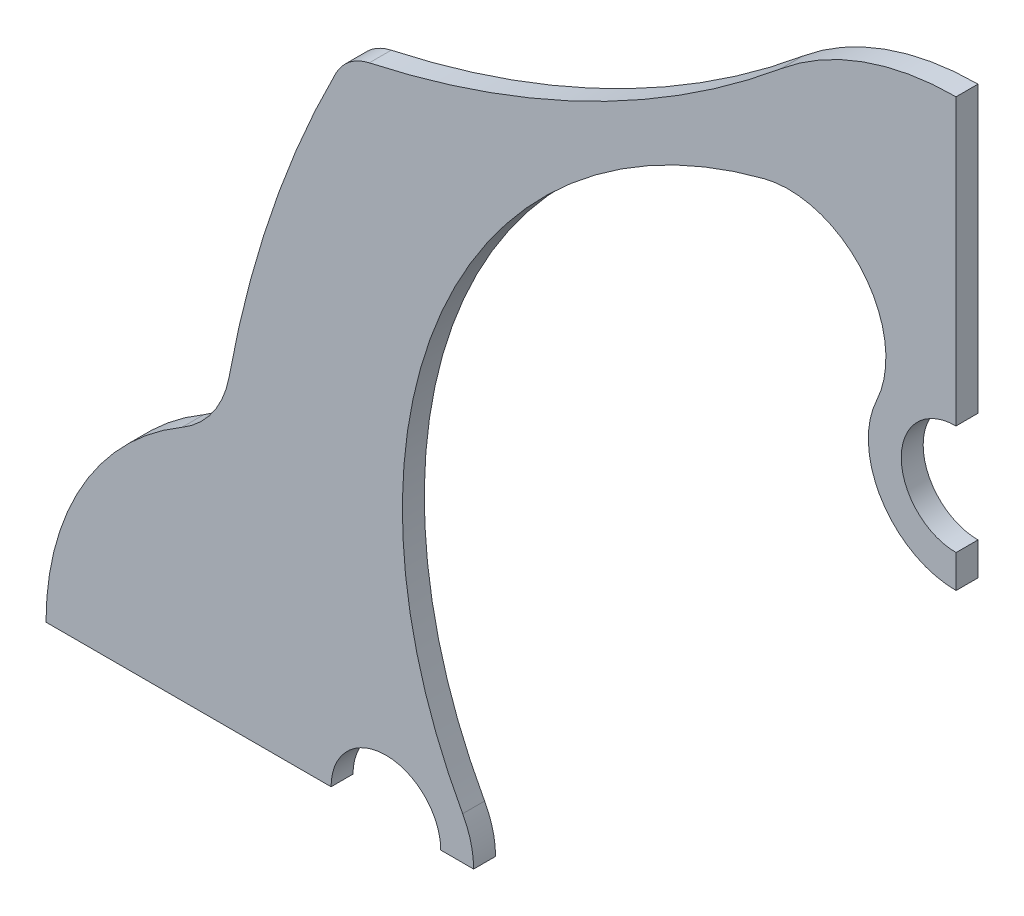
ISO-10303-21;
HEADER;
FILE_DESCRIPTION(('STEP AP214'),'2;1');
FILE_NAME('part.step','',(''),(''),'','','');
FILE_SCHEMA(('AUTOMOTIVE_DESIGN { 1 0 10303 214 1 1 1 1 }'));
ENDSEC;
DATA;
#1=APPLICATION_CONTEXT('core data for automotive mechanical design processes');
#2=APPLICATION_PROTOCOL_DEFINITION('international standard','automotive_design',2000,#1);
#3=PRODUCT_CONTEXT('',#1,'mechanical');
#4=PRODUCT('Part','Part','',(#3));
#5=PRODUCT_RELATED_PRODUCT_CATEGORY('part','',(#4));
#6=PRODUCT_DEFINITION_FORMATION('','',#4);
#7=PRODUCT_DEFINITION_CONTEXT('part definition',#1,'design');
#8=PRODUCT_DEFINITION('design','',#6,#7);
#9=PRODUCT_DEFINITION_SHAPE('','',#8);
#10=(LENGTH_UNIT() NAMED_UNIT(*) SI_UNIT(.MILLI.,.METRE.));
#11=(NAMED_UNIT(*) PLANE_ANGLE_UNIT() SI_UNIT($,.RADIAN.));
#12=(NAMED_UNIT(*) SI_UNIT($,.STERADIAN.) SOLID_ANGLE_UNIT());
#13=UNCERTAINTY_MEASURE_WITH_UNIT(LENGTH_MEASURE(1.E-05),#10,'distance_accuracy_value','');
#14=(GEOMETRIC_REPRESENTATION_CONTEXT(3) GLOBAL_UNCERTAINTY_ASSIGNED_CONTEXT((#13)) GLOBAL_UNIT_ASSIGNED_CONTEXT((#10,
#11,#12)) REPRESENTATION_CONTEXT('',''));
#15=CARTESIAN_POINT('',(0.,0.,0.));
#16=DIRECTION('',(0.,0.,1.));
#17=DIRECTION('',(1.,0.,0.));
#18=AXIS2_PLACEMENT_3D('',#15,#16,#17);
#19=CARTESIAN_POINT('',(-52.,0.,1.));
#20=DIRECTION('',(0.,0.,-1.));
#21=DIRECTION('',(-1.,0.,0.));
#22=AXIS2_PLACEMENT_3D('',#19,#20,#21);
#23=CYLINDRICAL_SURFACE('',#22,8.00000000000004);
#24=CARTESIAN_POINT('',(-52.,0.,-1.));
#25=DIRECTION('',(0.,0.,1.));
#26=DIRECTION('',(-1.,0.,0.));
#27=AXIS2_PLACEMENT_3D('',#24,#25,#26);
#28=CIRCLE('',#27,8.00000000000004);
#29=CARTESIAN_POINT('',(-44.,0.,-1.));
#30=VERTEX_POINT('',#29);
#31=CARTESIAN_POINT('',(-45.,3.87298334620741,-1.));
#32=VERTEX_POINT('',#31);
#33=EDGE_CURVE('E176',#30,#32,#28,.T.);
#34=ORIENTED_EDGE('',*,*,#33,.T.);
#35=DIRECTION('',(0.,0.,-1.));
#36=VECTOR('',#35,1.);
#37=CARTESIAN_POINT('',(-45.,3.87298334620741,1.));
#38=LINE('',#37,#36);
#39=CARTESIAN_POINT('',(-45.,3.87298334620741,1.));
#40=VERTEX_POINT('',#39);
#41=EDGE_CURVE('E11',#40,#32,#38,.T.);
#42=ORIENTED_EDGE('',*,*,#41,.F.);
#43=CARTESIAN_POINT('',(-52.,0.,1.));
#44=DIRECTION('',(0.,0.,1.));
#45=DIRECTION('',(-1.,0.,0.));
#46=AXIS2_PLACEMENT_3D('',#43,#44,#45);
#47=CIRCLE('',#46,8.00000000000004);
#48=CARTESIAN_POINT('',(-44.,0.,1.));
#49=VERTEX_POINT('',#48);
#50=EDGE_CURVE('E206',#49,#40,#47,.T.);
#51=ORIENTED_EDGE('',*,*,#50,.F.);
#52=DIRECTION('',(0.,0.,-1.));
#53=VECTOR('',#52,1.);
#54=CARTESIAN_POINT('',(-44.,0.,1.));
#55=LINE('',#54,#53);
#56=EDGE_CURVE('E172',#49,#30,#55,.T.);
#57=ORIENTED_EDGE('',*,*,#56,.T.);
#58=EDGE_LOOP('',(#34,#42,#51,#57));
#59=FACE_BOUND('',#58,.T.);
#60=ADVANCED_FACE('F32',(#59),#23,.T.);
#61=CARTESIAN_POINT('',(-6.50000000000001,25.1743917503482,1.));
#62=DIRECTION('',(0.,0.,-1.));
#63=DIRECTION('',(-1.,0.,0.));
#64=AXIS2_PLACEMENT_3D('',#61,#62,#63);
#65=CYLINDRICAL_SURFACE('',#64,44.);
#66=CARTESIAN_POINT('',(-6.50000000000001,25.1743917503482,-1.));
#67=DIRECTION('',(0.,0.,-1.));
#68=DIRECTION('',(-1.,0.,0.));
#69=AXIS2_PLACEMENT_3D('',#66,#67,#68);
#70=CIRCLE('',#69,44.);
#71=CARTESIAN_POINT('',(-17.5,67.7772085586298,-1.));
#72=VERTEX_POINT('',#71);
#73=EDGE_CURVE('E179',#32,#72,#70,.T.);
#74=ORIENTED_EDGE('',*,*,#73,.T.);
#75=DIRECTION('',(0.,0.,-1.));
#76=VECTOR('',#75,1.);
#77=CARTESIAN_POINT('',(-17.5,67.7772085586298,1.));
#78=LINE('',#77,#76);
#79=CARTESIAN_POINT('',(-17.5,67.7772085586298,1.));
#80=VERTEX_POINT('',#79);
#81=EDGE_CURVE('E40',#80,#72,#78,.T.);
#82=ORIENTED_EDGE('',*,*,#81,.F.);
#83=CARTESIAN_POINT('',(-6.50000000000001,25.1743917503482,1.));
#84=DIRECTION('',(0.,0.,-1.));
#85=DIRECTION('',(-1.,0.,0.));
#86=AXIS2_PLACEMENT_3D('',#83,#84,#85);
#87=CIRCLE('',#86,44.);
#88=EDGE_CURVE('E115',#40,#80,#87,.T.);
#89=ORIENTED_EDGE('',*,*,#88,.F.);
#90=ORIENTED_EDGE('',*,*,#41,.T.);
#91=EDGE_LOOP('',(#74,#82,#89,#90));
#92=FACE_BOUND('',#91,.T.);
#93=ADVANCED_FACE('F304',(#92),#65,.F.);
#94=CARTESIAN_POINT('',(-15.2796170834163,59.1777025004974,1.));
#95=DIRECTION('',(0.,0.,-1.));
#96=DIRECTION('',(-1.,0.,0.));
#97=AXIS2_PLACEMENT_3D('',#94,#95,#96);
#98=CYLINDRICAL_SURFACE('',#97,8.88153166633505);
#99=CARTESIAN_POINT('',(-15.2796170834163,59.1777025004974,-1.));
#100=DIRECTION('',(0.,0.,-1.));
#101=DIRECTION('',(-1.,0.,0.));
#102=AXIS2_PLACEMENT_3D('',#99,#100,#101);
#103=CIRCLE('',#102,8.88153166633505);
#104=CARTESIAN_POINT('',(-7.24086765841832,55.4014460973638,-1.));
#105=VERTEX_POINT('',#104);
#106=EDGE_CURVE('E181',#72,#105,#103,.T.);
#107=ORIENTED_EDGE('',*,*,#106,.T.);
#108=DIRECTION('',(0.,0.,-1.));
#109=VECTOR('',#108,1.);
#110=CARTESIAN_POINT('',(-7.24086765841832,55.4014460973638,1.));
#111=LINE('',#110,#109);
#112=CARTESIAN_POINT('',(-7.24086765841832,55.4014460973638,1.));
#113=VERTEX_POINT('',#112);
#114=EDGE_CURVE('E237',#113,#105,#111,.T.);
#115=ORIENTED_EDGE('',*,*,#114,.F.);
#116=CARTESIAN_POINT('',(-15.2796170834163,59.1777025004974,1.));
#117=DIRECTION('',(0.,0.,-1.));
#118=DIRECTION('',(-1.,0.,0.));
#119=AXIS2_PLACEMENT_3D('',#116,#117,#118);
#120=CIRCLE('',#119,8.88153166633505);
#121=EDGE_CURVE('E245',#80,#113,#120,.T.);
#122=ORIENTED_EDGE('',*,*,#121,.F.);
#123=ORIENTED_EDGE('',*,*,#81,.T.);
#124=EDGE_LOOP('',(#107,#115,#122,#123));
#125=FACE_BOUND('',#124,.T.);
#126=ADVANCED_FACE('F243',(#125),#98,.F.);
#127=CARTESIAN_POINT('',(0.,52.,1.));
#128=DIRECTION('',(0.,0.,-1.));
#129=DIRECTION('',(-1.,0.,0.));
#130=AXIS2_PLACEMENT_3D('',#127,#128,#129);
#131=CYLINDRICAL_SURFACE('',#130,8.00000000000001);
#132=CARTESIAN_POINT('',(0.,52.,-1.));
#133=DIRECTION('',(0.,0.,1.));
#134=DIRECTION('',(1.,0.,0.));
#135=AXIS2_PLACEMENT_3D('',#132,#133,#134);
#136=CIRCLE('',#135,8.00000000000001);
#137=CARTESIAN_POINT('',(0.,44.,-1.));
#138=VERTEX_POINT('',#137);
#139=EDGE_CURVE('E183',#105,#138,#136,.T.);
#140=ORIENTED_EDGE('',*,*,#139,.T.);
#141=DIRECTION('',(0.,0.,-1.));
#142=VECTOR('',#141,1.);
#143=CARTESIAN_POINT('',(0.,44.,1.));
#144=LINE('',#143,#142);
#145=CARTESIAN_POINT('',(0.,44.,1.));
#146=VERTEX_POINT('',#145);
#147=EDGE_CURVE('E234',#146,#138,#144,.T.);
#148=ORIENTED_EDGE('',*,*,#147,.F.);
#149=CARTESIAN_POINT('',(0.,52.,1.));
#150=DIRECTION('',(0.,0.,1.));
#151=DIRECTION('',(1.,0.,0.));
#152=AXIS2_PLACEMENT_3D('',#149,#150,#151);
#153=CIRCLE('',#152,8.00000000000001);
#154=EDGE_CURVE('E263',#113,#146,#153,.T.);
#155=ORIENTED_EDGE('',*,*,#154,.F.);
#156=ORIENTED_EDGE('',*,*,#114,.T.);
#157=EDGE_LOOP('',(#140,#148,#155,#156));
#158=FACE_BOUND('',#157,.T.);
#159=ADVANCED_FACE('F254',(#158),#131,.T.);
#160=CARTESIAN_POINT('',(0.,44.,1.));
#161=DIRECTION('',(-1.,0.,0.));
#162=DIRECTION('',(0.,0.,1.));
#163=AXIS2_PLACEMENT_3D('',#160,#161,#162);
#164=PLANE('',#163);
#165=DIRECTION('',(0.,1.,0.));
#166=VECTOR('',#165,1.);
#167=CARTESIAN_POINT('',(0.,44.,-1.));
#168=LINE('',#167,#166);
#169=CARTESIAN_POINT('',(0.,47.,-1.));
#170=VERTEX_POINT('',#169);
#171=EDGE_CURVE('E185',#138,#170,#168,.T.);
#172=ORIENTED_EDGE('',*,*,#171,.T.);
#173=DIRECTION('',(0.,0.,-1.));
#174=VECTOR('',#173,1.);
#175=CARTESIAN_POINT('',(0.,47.,1.));
#176=LINE('',#175,#174);
#177=CARTESIAN_POINT('',(0.,47.,1.));
#178=VERTEX_POINT('',#177);
#179=EDGE_CURVE('E231',#178,#170,#176,.T.);
#180=ORIENTED_EDGE('',*,*,#179,.F.);
#181=DIRECTION('',(0.,1.,0.));
#182=VECTOR('',#181,1.);
#183=CARTESIAN_POINT('',(0.,44.,1.));
#184=LINE('',#183,#182);
#185=EDGE_CURVE('E260',#146,#178,#184,.T.);
#186=ORIENTED_EDGE('',*,*,#185,.F.);
#187=ORIENTED_EDGE('',*,*,#147,.T.);
#188=EDGE_LOOP('',(#172,#180,#186,#187));
#189=FACE_BOUND('',#188,.T.);
#190=ADVANCED_FACE('F258',(#189),#164,.F.);
#191=CARTESIAN_POINT('',(0.,52.,1.));
#192=DIRECTION('',(0.,0.,-1.));
#193=DIRECTION('',(-1.,0.,0.));
#194=AXIS2_PLACEMENT_3D('',#191,#192,#193);
#195=CYLINDRICAL_SURFACE('',#194,5.);
#196=CARTESIAN_POINT('',(0.,52.,-1.));
#197=DIRECTION('',(0.,0.,-1.));
#198=DIRECTION('',(1.,0.,0.));
#199=AXIS2_PLACEMENT_3D('',#196,#197,#198);
#200=CIRCLE('',#199,5.);
#201=CARTESIAN_POINT('',(0.,57.,-1.));
#202=VERTEX_POINT('',#201);
#203=EDGE_CURVE('E187',#170,#202,#200,.T.);
#204=ORIENTED_EDGE('',*,*,#203,.T.);
#205=DIRECTION('',(0.,0.,-1.));
#206=VECTOR('',#205,1.);
#207=CARTESIAN_POINT('',(0.,57.,1.));
#208=LINE('',#207,#206);
#209=CARTESIAN_POINT('',(0.,57.,1.));
#210=VERTEX_POINT('',#209);
#211=EDGE_CURVE('E228',#210,#202,#208,.T.);
#212=ORIENTED_EDGE('',*,*,#211,.F.);
#213=CARTESIAN_POINT('',(0.,52.,1.));
#214=DIRECTION('',(0.,0.,-1.));
#215=DIRECTION('',(1.,0.,0.));
#216=AXIS2_PLACEMENT_3D('',#213,#214,#215);
#217=CIRCLE('',#216,5.);
#218=EDGE_CURVE('E262',#178,#210,#217,.T.);
#219=ORIENTED_EDGE('',*,*,#218,.F.);
#220=ORIENTED_EDGE('',*,*,#179,.T.);
#221=EDGE_LOOP('',(#204,#212,#219,#220));
#222=FACE_BOUND('',#221,.T.);
#223=ADVANCED_FACE('F317',(#222),#195,.F.);
#224=CARTESIAN_POINT('',(2.64922717411103E-13,83.,1.));
#225=DIRECTION('',(-1.,0.,0.));
#226=DIRECTION('',(0.,-1.,0.));
#227=AXIS2_PLACEMENT_3D('',#224,#225,#226);
#228=PLANE('',#227);
#229=DIRECTION('',(0.,1.,0.));
#230=VECTOR('',#229,1.);
#231=CARTESIAN_POINT('',(2.64922717411103E-13,83.,-1.));
#232=LINE('',#231,#230);
#233=CARTESIAN_POINT('',(2.64922717411103E-13,83.,-1.));
#234=VERTEX_POINT('',#233);
#235=EDGE_CURVE('E189',#202,#234,#232,.T.);
#236=ORIENTED_EDGE('',*,*,#235,.T.);
#237=DIRECTION('',(0.,0.,-1.));
#238=VECTOR('',#237,1.);
#239=CARTESIAN_POINT('',(2.64922717411103E-13,83.,1.));
#240=LINE('',#239,#238);
#241=CARTESIAN_POINT('',(2.64922717411103E-13,83.,1.));
#242=VERTEX_POINT('',#241);
#243=EDGE_CURVE('E225',#242,#234,#240,.T.);
#244=ORIENTED_EDGE('',*,*,#243,.F.);
#245=DIRECTION('',(0.,1.,0.));
#246=VECTOR('',#245,1.);
#247=CARTESIAN_POINT('',(2.64922717411103E-13,83.,1.));
#248=LINE('',#247,#246);
#249=EDGE_CURVE('E265',#210,#242,#248,.T.);
#250=ORIENTED_EDGE('',*,*,#249,.F.);
#251=ORIENTED_EDGE('',*,*,#211,.T.);
#252=EDGE_LOOP('',(#236,#244,#250,#251));
#253=FACE_BOUND('',#252,.T.);
#254=ADVANCED_FACE('F320',(#253),#228,.F.);
#255=CARTESIAN_POINT('',(0.,58.,1.));
#256=DIRECTION('',(0.,0.,-1.));
#257=DIRECTION('',(-1.,0.,0.));
#258=AXIS2_PLACEMENT_3D('',#255,#256,#257);
#259=CYLINDRICAL_SURFACE('',#258,25.);
#260=CARTESIAN_POINT('',(0.,58.,-1.));
#261=DIRECTION('',(0.,0.,1.));
#262=DIRECTION('',(-1.,0.,0.));
#263=AXIS2_PLACEMENT_3D('',#260,#261,#262);
#264=CIRCLE('',#263,25.);
#265=CARTESIAN_POINT('',(-15.9770127870759,77.2284961034818,-1.));
#266=VERTEX_POINT('',#265);
#267=EDGE_CURVE('E191',#234,#266,#264,.T.);
#268=ORIENTED_EDGE('',*,*,#267,.T.);
#269=DIRECTION('',(0.,0.,-1.));
#270=VECTOR('',#269,1.);
#271=CARTESIAN_POINT('',(-15.9770127870759,77.2284961034818,1.));
#272=LINE('',#271,#270);
#273=CARTESIAN_POINT('',(-15.9770127870759,77.2284961034818,1.));
#274=VERTEX_POINT('',#273);
#275=EDGE_CURVE('E222',#274,#266,#272,.T.);
#276=ORIENTED_EDGE('',*,*,#275,.F.);
#277=CARTESIAN_POINT('',(0.,58.,1.));
#278=DIRECTION('',(0.,0.,1.));
#279=DIRECTION('',(-1.,0.,0.));
#280=AXIS2_PLACEMENT_3D('',#277,#278,#279);
#281=CIRCLE('',#280,25.);
#282=EDGE_CURVE('E271',#242,#274,#281,.T.);
#283=ORIENTED_EDGE('',*,*,#282,.F.);
#284=ORIENTED_EDGE('',*,*,#243,.T.);
#285=EDGE_LOOP('',(#268,#276,#283,#284));
#286=FACE_BOUND('',#285,.T.);
#287=ADVANCED_FACE('F324',(#286),#259,.T.);
#288=CARTESIAN_POINT('',(-72.2160977975829,144.912802387738,1.));
#289=DIRECTION('',(0.,0.,-1.));
#290=DIRECTION('',(-1.,0.,0.));
#291=AXIS2_PLACEMENT_3D('',#288,#289,#290);
#292=CYLINDRICAL_SURFACE('',#291,88.);
#293=CARTESIAN_POINT('',(-72.2160977975829,144.912802387738,-1.));
#294=DIRECTION('',(0.,0.,-1.));
#295=DIRECTION('',(1.,0.,0.));
#296=AXIS2_PLACEMENT_3D('',#293,#294,#295);
#297=CIRCLE('',#296,88.);
#298=CARTESIAN_POINT('',(-53.515303741231,58.9228012151484,-1.));
#299=VERTEX_POINT('',#298);
#300=EDGE_CURVE('E193',#266,#299,#297,.T.);
#301=ORIENTED_EDGE('',*,*,#300,.T.);
#302=DIRECTION('',(0.,0.,-1.));
#303=VECTOR('',#302,1.);
#304=CARTESIAN_POINT('',(-53.515303741231,58.9228012151484,1.));
#305=LINE('',#304,#303);
#306=CARTESIAN_POINT('',(-53.515303741231,58.9228012151484,1.));
#307=VERTEX_POINT('',#306);
#308=EDGE_CURVE('E219',#307,#299,#305,.T.);
#309=ORIENTED_EDGE('',*,*,#308,.F.);
#310=CARTESIAN_POINT('',(-72.2160977975829,144.912802387738,1.));
#311=DIRECTION('',(0.,0.,-1.));
#312=DIRECTION('',(1.,0.,0.));
#313=AXIS2_PLACEMENT_3D('',#310,#311,#312);
#314=CIRCLE('',#313,88.);
#315=EDGE_CURVE('E273',#274,#307,#314,.T.);
#316=ORIENTED_EDGE('',*,*,#315,.F.);
#317=ORIENTED_EDGE('',*,*,#275,.T.);
#318=EDGE_LOOP('',(#301,#309,#316,#317));
#319=FACE_BOUND('',#318,.T.);
#320=ADVANCED_FACE('F328',(#319),#292,.F.);
#321=CARTESIAN_POINT('',(-52.5590131360765,54.5255852460956,1.));
#322=DIRECTION('',(0.,0.,-1.));
#323=DIRECTION('',(-1.,0.,0.));
#324=AXIS2_PLACEMENT_3D('',#321,#322,#323);
#325=CYLINDRICAL_SURFACE('',#324,4.49999999999991);
#326=CARTESIAN_POINT('',(-52.5590131360765,54.5255852460956,-1.));
#327=DIRECTION('',(0.,0.,1.));
#328=DIRECTION('',(1.,0.,0.));
#329=AXIS2_PLACEMENT_3D('',#326,#327,#328);
#330=CIRCLE('',#329,4.49999999999991);
#331=CARTESIAN_POINT('',(-56.5685424949241,56.5685424949235,-1.));
#332=VERTEX_POINT('',#331);
#333=EDGE_CURVE('E195',#299,#332,#330,.T.);
#334=ORIENTED_EDGE('',*,*,#333,.T.);
#335=DIRECTION('',(0.,0.,-1.));
#336=VECTOR('',#335,1.);
#337=CARTESIAN_POINT('',(-56.5685424949241,56.5685424949235,1.));
#338=LINE('',#337,#336);
#339=CARTESIAN_POINT('',(-56.5685424949241,56.5685424949235,1.));
#340=VERTEX_POINT('',#339);
#341=EDGE_CURVE('E216',#340,#332,#338,.T.);
#342=ORIENTED_EDGE('',*,*,#341,.F.);
#343=CARTESIAN_POINT('',(-52.5590131360765,54.5255852460956,1.));
#344=DIRECTION('',(0.,0.,1.));
#345=DIRECTION('',(1.,0.,0.));
#346=AXIS2_PLACEMENT_3D('',#343,#344,#345);
#347=CIRCLE('',#346,4.49999999999991);
#348=EDGE_CURVE('E275',#307,#340,#347,.T.);
#349=ORIENTED_EDGE('',*,*,#348,.F.);
#350=ORIENTED_EDGE('',*,*,#308,.T.);
#351=EDGE_LOOP('',(#334,#342,#349,#350));
#352=FACE_BOUND('',#351,.T.);
#353=ADVANCED_FACE('F332',(#352),#325,.T.);
#354=CARTESIAN_POINT('',(36.7015730945028,9.04504492482461,1.));
#355=DIRECTION('',(0.,0.,-1.));
#356=DIRECTION('',(-1.,0.,0.));
#357=AXIS2_PLACEMENT_3D('',#354,#355,#356);
#358=CYLINDRICAL_SURFACE('',#357,104.679497913203);
#359=CARTESIAN_POINT('',(36.7015730945028,9.04504492482461,-1.));
#360=DIRECTION('',(0.,0.,1.));
#361=DIRECTION('',(1.,0.,0.));
#362=AXIS2_PLACEMENT_3D('',#359,#360,#361);
#363=CIRCLE('',#362,104.679497913203);
#364=CARTESIAN_POINT('',(-66.2930950940034,27.7505416597358,-1.));
#365=VERTEX_POINT('',#364);
#366=EDGE_CURVE('E197',#332,#365,#363,.T.);
#367=ORIENTED_EDGE('',*,*,#366,.T.);
#368=DIRECTION('',(0.,0.,-1.));
#369=VECTOR('',#368,1.);
#370=CARTESIAN_POINT('',(-66.2930950940034,27.7505416597358,1.));
#371=LINE('',#370,#369);
#372=CARTESIAN_POINT('',(-66.2930950940034,27.7505416597358,1.));
#373=VERTEX_POINT('',#372);
#374=EDGE_CURVE('E213',#373,#365,#371,.T.);
#375=ORIENTED_EDGE('',*,*,#374,.F.);
#376=CARTESIAN_POINT('',(36.7015730945028,9.04504492482461,1.));
#377=DIRECTION('',(0.,0.,1.));
#378=DIRECTION('',(1.,0.,0.));
#379=AXIS2_PLACEMENT_3D('',#376,#377,#378);
#380=CIRCLE('',#379,104.679497913203);
#381=EDGE_CURVE('E277',#340,#373,#380,.T.);
#382=ORIENTED_EDGE('',*,*,#381,.F.);
#383=ORIENTED_EDGE('',*,*,#341,.T.);
#384=EDGE_LOOP('',(#367,#375,#382,#383));
#385=FACE_BOUND('',#384,.T.);
#386=ADVANCED_FACE('F336',(#385),#358,.T.);
#387=CARTESIAN_POINT('',(-75.1482389586133,29.3587789360914,1.));
#388=DIRECTION('',(0.,0.,-1.));
#389=DIRECTION('',(-1.,0.,0.));
#390=AXIS2_PLACEMENT_3D('',#387,#388,#389);
#391=CYLINDRICAL_SURFACE('',#390,9.0000000000002);
#392=CARTESIAN_POINT('',(-75.1482389586133,29.3587789360914,-1.));
#393=DIRECTION('',(0.,0.,-1.));
#394=DIRECTION('',(1.,0.,0.));
#395=AXIS2_PLACEMENT_3D('',#392,#393,#394);
#396=CIRCLE('',#395,9.0000000000002);
#397=CARTESIAN_POINT('',(-70.6089992342742,21.5873374530083,-1.));
#398=VERTEX_POINT('',#397);
#399=EDGE_CURVE('E199',#365,#398,#396,.T.);
#400=ORIENTED_EDGE('',*,*,#399,.T.);
#401=DIRECTION('',(0.,0.,-1.));
#402=VECTOR('',#401,1.);
#403=CARTESIAN_POINT('',(-70.6089992342742,21.5873374530083,1.));
#404=LINE('',#403,#402);
#405=CARTESIAN_POINT('',(-70.6089992342742,21.5873374530083,1.));
#406=VERTEX_POINT('',#405);
#407=EDGE_CURVE('E210',#406,#398,#404,.T.);
#408=ORIENTED_EDGE('',*,*,#407,.F.);
#409=CARTESIAN_POINT('',(-75.1482389586133,29.3587789360914,1.));
#410=DIRECTION('',(0.,0.,-1.));
#411=DIRECTION('',(1.,0.,0.));
#412=AXIS2_PLACEMENT_3D('',#409,#410,#411);
#413=CIRCLE('',#412,9.0000000000002);
#414=EDGE_CURVE('E279',#373,#406,#413,.T.);
#415=ORIENTED_EDGE('',*,*,#414,.F.);
#416=ORIENTED_EDGE('',*,*,#374,.T.);
#417=EDGE_LOOP('',(#400,#408,#415,#416));
#418=FACE_BOUND('',#417,.T.);
#419=ADVANCED_FACE('F285',(#418),#391,.F.);
#420=CARTESIAN_POINT('',(-57.9999999999998,-1.21430643318376E-13,1.));
#421=DIRECTION('',(0.,0.,-1.));
#422=DIRECTION('',(-1.,0.,0.));
#423=AXIS2_PLACEMENT_3D('',#420,#421,#422);
#424=CYLINDRICAL_SURFACE('',#423,24.9999999999987);
#425=CARTESIAN_POINT('',(-57.9999999999998,-1.21430643318376E-13,-1.));
#426=DIRECTION('',(0.,0.,1.));
#427=DIRECTION('',(-1.,0.,0.));
#428=AXIS2_PLACEMENT_3D('',#425,#426,#427);
#429=CIRCLE('',#428,24.9999999999987);
#430=CARTESIAN_POINT('',(-82.9999999999985,6.65439925384732E-13,-1.));
#431=VERTEX_POINT('',#430);
#432=EDGE_CURVE('E201',#398,#431,#429,.T.);
#433=ORIENTED_EDGE('',*,*,#432,.T.);
#434=DIRECTION('',(0.,0.,-1.));
#435=VECTOR('',#434,1.);
#436=CARTESIAN_POINT('',(-82.9999999999985,6.65439925384732E-13,1.));
#437=LINE('',#436,#435);
#438=CARTESIAN_POINT('',(-82.9999999999985,6.65439925384732E-13,1.));
#439=VERTEX_POINT('',#438);
#440=EDGE_CURVE('E167',#439,#431,#437,.T.);
#441=ORIENTED_EDGE('',*,*,#440,.F.);
#442=CARTESIAN_POINT('',(-57.9999999999998,-1.21430643318376E-13,1.));
#443=DIRECTION('',(0.,0.,1.));
#444=DIRECTION('',(-1.,0.,0.));
#445=AXIS2_PLACEMENT_3D('',#442,#443,#444);
#446=CIRCLE('',#445,24.9999999999987);
#447=EDGE_CURVE('E158',#406,#439,#446,.T.);
#448=ORIENTED_EDGE('',*,*,#447,.F.);
#449=ORIENTED_EDGE('',*,*,#407,.T.);
#450=EDGE_LOOP('',(#433,#441,#448,#449));
#451=FACE_BOUND('',#450,.T.);
#452=ADVANCED_FACE('F289',(#451),#424,.T.);
#453=CARTESIAN_POINT('',(-82.9999999999975,6.65439925384702E-13,1.));
#454=DIRECTION('',(0.,1.,0.));
#455=DIRECTION('',(-1.,0.,0.));
#456=AXIS2_PLACEMENT_3D('',#453,#454,#455);
#457=PLANE('',#456);
#458=DIRECTION('',(1.,0.,0.));
#459=VECTOR('',#458,1.);
#460=CARTESIAN_POINT('',(-82.9999999999975,6.65439925384702E-13,-1.));
#461=LINE('',#460,#459);
#462=CARTESIAN_POINT('',(-57.,0.,-1.));
#463=VERTEX_POINT('',#462);
#464=EDGE_CURVE('E166',#431,#463,#461,.T.);
#465=ORIENTED_EDGE('',*,*,#464,.T.);
#466=DIRECTION('',(0.,0.,-1.));
#467=VECTOR('',#466,1.);
#468=CARTESIAN_POINT('',(-57.,0.,1.));
#469=LINE('',#468,#467);
#470=CARTESIAN_POINT('',(-57.,0.,1.));
#471=VERTEX_POINT('',#470);
#472=EDGE_CURVE('E163',#471,#463,#469,.T.);
#473=ORIENTED_EDGE('',*,*,#472,.F.);
#474=DIRECTION('',(1.,0.,0.));
#475=VECTOR('',#474,1.);
#476=CARTESIAN_POINT('',(-82.9999999999975,6.65439925384702E-13,1.));
#477=LINE('',#476,#475);
#478=EDGE_CURVE('E152',#439,#471,#477,.T.);
#479=ORIENTED_EDGE('',*,*,#478,.F.);
#480=ORIENTED_EDGE('',*,*,#440,.T.);
#481=EDGE_LOOP('',(#465,#473,#479,#480));
#482=FACE_BOUND('',#481,.T.);
#483=ADVANCED_FACE('F164',(#482),#457,.F.);
#484=CARTESIAN_POINT('',(-52.,0.,1.));
#485=DIRECTION('',(0.,0.,-1.));
#486=DIRECTION('',(-1.,0.,0.));
#487=AXIS2_PLACEMENT_3D('',#484,#485,#486);
#488=CYLINDRICAL_SURFACE('',#487,5.);
#489=CARTESIAN_POINT('',(-52.,0.,-1.));
#490=DIRECTION('',(0.,0.,-1.));
#491=DIRECTION('',(1.,0.,0.));
#492=AXIS2_PLACEMENT_3D('',#489,#490,#491);
#493=CIRCLE('',#492,5.);
#494=CARTESIAN_POINT('',(-47.,0.,-1.));
#495=VERTEX_POINT('',#494);
#496=EDGE_CURVE('E101',#463,#495,#493,.T.);
#497=ORIENTED_EDGE('',*,*,#496,.T.);
#498=DIRECTION('',(0.,0.,-1.));
#499=VECTOR('',#498,1.);
#500=CARTESIAN_POINT('',(-47.,0.,1.));
#501=LINE('',#500,#499);
#502=CARTESIAN_POINT('',(-47.,0.,1.));
#503=VERTEX_POINT('',#502);
#504=EDGE_CURVE('E168',#503,#495,#501,.T.);
#505=ORIENTED_EDGE('',*,*,#504,.F.);
#506=CARTESIAN_POINT('',(-52.,0.,1.));
#507=DIRECTION('',(0.,0.,-1.));
#508=DIRECTION('',(1.,0.,0.));
#509=AXIS2_PLACEMENT_3D('',#506,#507,#508);
#510=CIRCLE('',#509,5.);
#511=EDGE_CURVE('E156',#471,#503,#510,.T.);
#512=ORIENTED_EDGE('',*,*,#511,.F.);
#513=ORIENTED_EDGE('',*,*,#472,.T.);
#514=EDGE_LOOP('',(#497,#505,#512,#513));
#515=FACE_BOUND('',#514,.T.);
#516=ADVANCED_FACE('F170',(#515),#488,.F.);
#517=CARTESIAN_POINT('',(-47.,0.,1.));
#518=DIRECTION('',(0.,1.,0.));
#519=DIRECTION('',(0.,0.,1.));
#520=AXIS2_PLACEMENT_3D('',#517,#518,#519);
#521=PLANE('',#520);
#522=DIRECTION('',(1.,0.,0.));
#523=VECTOR('',#522,1.);
#524=CARTESIAN_POINT('',(-47.,0.,-1.));
#525=LINE('',#524,#523);
#526=EDGE_CURVE('E107',#495,#30,#525,.T.);
#527=ORIENTED_EDGE('',*,*,#526,.T.);
#528=ORIENTED_EDGE('',*,*,#56,.F.);
#529=DIRECTION('',(1.,0.,0.));
#530=VECTOR('',#529,1.);
#531=CARTESIAN_POINT('',(-47.,0.,1.));
#532=LINE('',#531,#530);
#533=EDGE_CURVE('E48',#503,#49,#532,.T.);
#534=ORIENTED_EDGE('',*,*,#533,.F.);
#535=ORIENTED_EDGE('',*,*,#504,.T.);
#536=EDGE_LOOP('',(#527,#528,#534,#535));
#537=FACE_BOUND('',#536,.T.);
#538=ADVANCED_FACE('F293',(#537),#521,.F.);
#539=CARTESIAN_POINT('',(-52.,0.,1.));
#540=DIRECTION('',(0.,0.,-1.));
#541=DIRECTION('',(-1.,0.,0.));
#542=AXIS2_PLACEMENT_3D('',#539,#540,#541);
#543=PLANE('',#542);
#544=ORIENTED_EDGE('',*,*,#50,.T.);
#545=ORIENTED_EDGE('',*,*,#88,.T.);
#546=ORIENTED_EDGE('',*,*,#121,.T.);
#547=ORIENTED_EDGE('',*,*,#154,.T.);
#548=ORIENTED_EDGE('',*,*,#185,.T.);
#549=ORIENTED_EDGE('',*,*,#218,.T.);
#550=ORIENTED_EDGE('',*,*,#249,.T.);
#551=ORIENTED_EDGE('',*,*,#282,.T.);
#552=ORIENTED_EDGE('',*,*,#315,.T.);
#553=ORIENTED_EDGE('',*,*,#348,.T.);
#554=ORIENTED_EDGE('',*,*,#381,.T.);
#555=ORIENTED_EDGE('',*,*,#414,.T.);
#556=ORIENTED_EDGE('',*,*,#447,.T.);
#557=ORIENTED_EDGE('',*,*,#478,.T.);
#558=ORIENTED_EDGE('',*,*,#511,.T.);
#559=ORIENTED_EDGE('',*,*,#533,.T.);
#560=EDGE_LOOP('',(#544,#545,#546,#547,#548,#549,#550,#551,#552,#553,#554,#555,#556,#557,#558,#559));
#561=FACE_BOUND('',#560,.T.);
#562=ADVANCED_FACE('F154',(#561),#543,.F.);
#563=CARTESIAN_POINT('',(-52.,0.,-1.));
#564=DIRECTION('',(0.,0.,-1.));
#565=DIRECTION('',(-1.,0.,0.));
#566=AXIS2_PLACEMENT_3D('',#563,#564,#565);
#567=PLANE('',#566);
#568=ORIENTED_EDGE('',*,*,#33,.F.);
#569=ORIENTED_EDGE('',*,*,#526,.F.);
#570=ORIENTED_EDGE('',*,*,#496,.F.);
#571=ORIENTED_EDGE('',*,*,#464,.F.);
#572=ORIENTED_EDGE('',*,*,#432,.F.);
#573=ORIENTED_EDGE('',*,*,#399,.F.);
#574=ORIENTED_EDGE('',*,*,#366,.F.);
#575=ORIENTED_EDGE('',*,*,#333,.F.);
#576=ORIENTED_EDGE('',*,*,#300,.F.);
#577=ORIENTED_EDGE('',*,*,#267,.F.);
#578=ORIENTED_EDGE('',*,*,#235,.F.);
#579=ORIENTED_EDGE('',*,*,#203,.F.);
#580=ORIENTED_EDGE('',*,*,#171,.F.);
#581=ORIENTED_EDGE('',*,*,#139,.F.);
#582=ORIENTED_EDGE('',*,*,#106,.F.);
#583=ORIENTED_EDGE('',*,*,#73,.F.);
#584=EDGE_LOOP('',(#568,#569,#570,#571,#572,#573,#574,#575,#576,#577,#578,#579,#580,#581,#582,#583));
#585=FACE_BOUND('',#584,.T.);
#586=ADVANCED_FACE('F249',(#585),#567,.T.);
#587=CLOSED_SHELL('',(#60,#93,#126,#159,#190,#223,#254,#287,#320,#353,#386,#419,#452,#483,#516,
#538,#562,#586));
#588=MANIFOLD_SOLID_BREP('B2',#587);
#589=ADVANCED_BREP_SHAPE_REPRESENTATION('',(#18,#588),#14);
#590=SHAPE_DEFINITION_REPRESENTATION(#9,#589);
ENDSEC;
END-ISO-10303-21;
